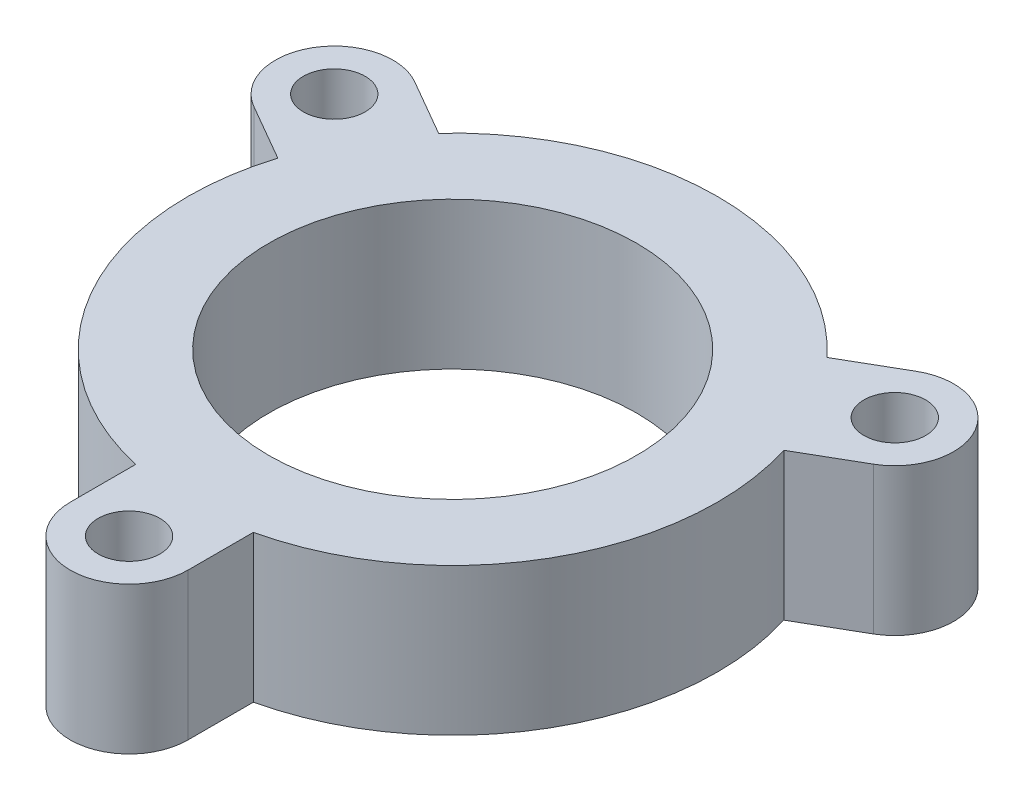
ISO-10303-21;
HEADER;
FILE_DESCRIPTION(('STEP AP214'),'2;1');
FILE_NAME('part.step','',(''),(''),'','','');
FILE_SCHEMA(('AUTOMOTIVE_DESIGN { 1 0 10303 214 1 1 1 1 }'));
ENDSEC;
DATA;
#1=APPLICATION_CONTEXT('core data for automotive mechanical design processes');
#2=APPLICATION_PROTOCOL_DEFINITION('international standard','automotive_design',2000,#1);
#3=PRODUCT_CONTEXT('',#1,'mechanical');
#4=PRODUCT('Part','Part','',(#3));
#5=PRODUCT_RELATED_PRODUCT_CATEGORY('part','',(#4));
#6=PRODUCT_DEFINITION_FORMATION('','',#4);
#7=PRODUCT_DEFINITION_CONTEXT('part definition',#1,'design');
#8=PRODUCT_DEFINITION('design','',#6,#7);
#9=PRODUCT_DEFINITION_SHAPE('','',#8);
#10=(LENGTH_UNIT() NAMED_UNIT(*) SI_UNIT(.MILLI.,.METRE.));
#11=(NAMED_UNIT(*) PLANE_ANGLE_UNIT() SI_UNIT($,.RADIAN.));
#12=(NAMED_UNIT(*) SI_UNIT($,.STERADIAN.) SOLID_ANGLE_UNIT());
#13=UNCERTAINTY_MEASURE_WITH_UNIT(LENGTH_MEASURE(1.E-05),#10,'distance_accuracy_value','');
#14=(GEOMETRIC_REPRESENTATION_CONTEXT(3) GLOBAL_UNCERTAINTY_ASSIGNED_CONTEXT((#13)) GLOBAL_UNIT_ASSIGNED_CONTEXT((#10,
#11,#12)) REPRESENTATION_CONTEXT('',''));
#15=CARTESIAN_POINT('',(0.,0.,0.));
#16=DIRECTION('',(0.,0.,1.));
#17=DIRECTION('',(1.,0.,0.));
#18=AXIS2_PLACEMENT_3D('',#15,#16,#17);
#19=CARTESIAN_POINT('',(0.,10.,22.));
#20=DIRECTION('',(0.,-1.,0.));
#21=DIRECTION('',(0.,0.,-1.));
#22=AXIS2_PLACEMENT_3D('',#19,#20,#21);
#23=CYLINDRICAL_SURFACE('',#22,2.1);
#24=CARTESIAN_POINT('',(0.,10.,22.));
#25=DIRECTION('',(0.,1.,0.));
#26=DIRECTION('',(0.,0.,1.));
#27=AXIS2_PLACEMENT_3D('',#24,#25,#26);
#28=CIRCLE('',#27,2.1);
#29=CARTESIAN_POINT('',(0.,10.,24.1));
#30=VERTEX_POINT('',#29);
#31=EDGE_CURVE('E242',#30,#30,#28,.T.);
#32=ORIENTED_EDGE('',*,*,#31,.T.);
#33=EDGE_LOOP('',(#32));
#34=FACE_BOUND('',#33,.T.);
#35=CARTESIAN_POINT('',(0.,0.,22.));
#36=DIRECTION('',(0.,1.,0.));
#37=DIRECTION('',(0.,0.,1.));
#38=AXIS2_PLACEMENT_3D('',#35,#36,#37);
#39=CIRCLE('',#38,2.1);
#40=CARTESIAN_POINT('',(0.,0.,24.1));
#41=VERTEX_POINT('',#40);
#42=EDGE_CURVE('E279',#41,#41,#39,.T.);
#43=ORIENTED_EDGE('',*,*,#42,.F.);
#44=EDGE_LOOP('',(#43));
#45=FACE_BOUND('',#44,.T.);
#46=ADVANCED_FACE('F118',(#34,#45),#23,.F.);
#47=CARTESIAN_POINT('',(0.,0.,0.));
#48=DIRECTION('',(0.,1.,0.));
#49=DIRECTION('',(0.,0.,1.));
#50=AXIS2_PLACEMENT_3D('',#47,#48,#49);
#51=PLANE('',#50);
#52=CARTESIAN_POINT('',(0.,0.,22.));
#53=DIRECTION('',(0.,1.,0.));
#54=DIRECTION('',(0.,0.,1.));
#55=AXIS2_PLACEMENT_3D('',#52,#53,#54);
#56=CIRCLE('',#55,4.);
#57=CARTESIAN_POINT('',(-4.,0.,22.));
#58=VERTEX_POINT('',#57);
#59=CARTESIAN_POINT('',(4.,0.,22.));
#60=VERTEX_POINT('',#59);
#61=EDGE_CURVE('E254',#58,#60,#56,.T.);
#62=ORIENTED_EDGE('',*,*,#61,.F.);
#63=DIRECTION('',(0.,0.,-1.));
#64=VECTOR('',#63,1.);
#65=CARTESIAN_POINT('',(-4.,0.,0.));
#66=LINE('',#65,#64);
#67=CARTESIAN_POINT('',(-4.,0.,17.5499287747842));
#68=VERTEX_POINT('',#67);
#69=EDGE_CURVE('E251',#58,#68,#66,.T.);
#70=ORIENTED_EDGE('',*,*,#69,.T.);
#71=CARTESIAN_POINT('',(0.,0.,0.));
#72=DIRECTION('',(0.,1.,0.));
#73=DIRECTION('',(0.,0.,1.));
#74=AXIS2_PLACEMENT_3D('',#71,#72,#73);
#75=CIRCLE('',#74,18.);
#76=CARTESIAN_POINT('',(-17.1986841535706,0.,-5.31086277225445));
#77=VERTEX_POINT('',#76);
#78=EDGE_CURVE('E263',#77,#68,#75,.T.);
#79=ORIENTED_EDGE('',*,*,#78,.F.);
#80=DIRECTION('',(0.866025403784436,0.,0.500000000000004));
#81=VECTOR('',#80,1.);
#82=CARTESIAN_POINT('',(-2.00000000000001,0.,3.46410161513774));
#83=LINE('',#82,#81);
#84=CARTESIAN_POINT('',(-21.0525588832576,0.,-7.53589838486234));
#85=VERTEX_POINT('',#84);
#86=EDGE_CURVE('E175',#85,#77,#83,.T.);
#87=ORIENTED_EDGE('',*,*,#86,.F.);
#88=CARTESIAN_POINT('',(-19.0525588832576,0.,-11.0000000000001));
#89=DIRECTION('',(0.,1.,0.));
#90=DIRECTION('',(0.,0.,1.));
#91=AXIS2_PLACEMENT_3D('',#88,#89,#90);
#92=CIRCLE('',#91,4.);
#93=CARTESIAN_POINT('',(-17.0525588832576,0.,-14.4641016151378));
#94=VERTEX_POINT('',#93);
#95=EDGE_CURVE('E228',#94,#85,#92,.T.);
#96=ORIENTED_EDGE('',*,*,#95,.F.);
#97=DIRECTION('',(0.866025403784436,0.,0.500000000000004));
#98=VECTOR('',#97,1.);
#99=CARTESIAN_POINT('',(2.00000000000002,0.,-3.46410161513775));
#100=LINE('',#99,#98);
#101=CARTESIAN_POINT('',(-13.1986841535706,0.,-12.2390660025299));
#102=VERTEX_POINT('',#101);
#103=EDGE_CURVE('E271',#94,#102,#100,.T.);
#104=ORIENTED_EDGE('',*,*,#103,.T.);
#105=CARTESIAN_POINT('',(13.1986841535708,0.,-12.2390660025298));
#106=VERTEX_POINT('',#105);
#107=EDGE_CURVE('E264',#106,#102,#75,.T.);
#108=ORIENTED_EDGE('',*,*,#107,.F.);
#109=DIRECTION('',(-0.866025403784443,0.,0.499999999999992));
#110=VECTOR('',#109,1.);
#111=CARTESIAN_POINT('',(-1.99999999999997,0.,-3.46410161513777));
#112=LINE('',#111,#110);
#113=CARTESIAN_POINT('',(17.0525588832578,0.,-14.4641016151376));
#114=VERTEX_POINT('',#113);
#115=EDGE_CURVE('E269',#114,#106,#112,.T.);
#116=ORIENTED_EDGE('',*,*,#115,.F.);
#117=CARTESIAN_POINT('',(19.0525588832578,0.,-10.9999999999998));
#118=DIRECTION('',(0.,1.,0.));
#119=DIRECTION('',(0.,0.,1.));
#120=AXIS2_PLACEMENT_3D('',#117,#118,#119);
#121=CIRCLE('',#120,4.);
#122=CARTESIAN_POINT('',(21.0525588832577,0.,-7.53589838486205));
#123=VERTEX_POINT('',#122);
#124=EDGE_CURVE('E267',#123,#114,#121,.T.);
#125=ORIENTED_EDGE('',*,*,#124,.F.);
#126=DIRECTION('',(-0.866025403784443,0.,0.499999999999992));
#127=VECTOR('',#126,1.);
#128=CARTESIAN_POINT('',(1.99999999999997,0.,3.46410161513777));
#129=LINE('',#128,#127);
#130=CARTESIAN_POINT('',(17.1986841535707,0.,-5.31086277225421));
#131=VERTEX_POINT('',#130);
#132=EDGE_CURVE('E262',#123,#131,#129,.T.);
#133=ORIENTED_EDGE('',*,*,#132,.T.);
#134=CARTESIAN_POINT('',(4.,0.,17.5499287747842));
#135=VERTEX_POINT('',#134);
#136=EDGE_CURVE('E259',#135,#131,#75,.T.);
#137=ORIENTED_EDGE('',*,*,#136,.F.);
#138=DIRECTION('',(0.,0.,-1.));
#139=VECTOR('',#138,1.);
#140=CARTESIAN_POINT('',(4.,0.,0.));
#141=LINE('',#140,#139);
#142=EDGE_CURVE('E257',#60,#135,#141,.T.);
#143=ORIENTED_EDGE('',*,*,#142,.F.);
#144=EDGE_LOOP('',(#62,#70,#79,#87,#96,#104,#108,#116,#125,#133,#137,#143));
#145=FACE_BOUND('',#144,.T.);
#146=ORIENTED_EDGE('',*,*,#42,.T.);
#147=EDGE_LOOP('',(#146));
#148=FACE_BOUND('',#147,.T.);
#149=CARTESIAN_POINT('',(-19.0525588832576,0.,-11.0000000000001));
#150=DIRECTION('',(0.,1.,0.));
#151=DIRECTION('',(0.,0.,1.));
#152=AXIS2_PLACEMENT_3D('',#149,#150,#151);
#153=CIRCLE('',#152,2.1);
#154=CARTESIAN_POINT('',(-19.0525588832576,0.,-8.90000000000009));
#155=VERTEX_POINT('',#154);
#156=EDGE_CURVE('E285',#155,#155,#153,.T.);
#157=ORIENTED_EDGE('',*,*,#156,.T.);
#158=EDGE_LOOP('',(#157));
#159=FACE_BOUND('',#158,.T.);
#160=CARTESIAN_POINT('',(19.0525588832578,0.,-10.9999999999998));
#161=DIRECTION('',(0.,1.,0.));
#162=DIRECTION('',(0.,0.,1.));
#163=AXIS2_PLACEMENT_3D('',#160,#161,#162);
#164=CIRCLE('',#163,2.1);
#165=CARTESIAN_POINT('',(19.0525588832578,0.,-8.89999999999982));
#166=VERTEX_POINT('',#165);
#167=EDGE_CURVE('E282',#166,#166,#164,.T.);
#168=ORIENTED_EDGE('',*,*,#167,.T.);
#169=EDGE_LOOP('',(#168));
#170=FACE_BOUND('',#169,.T.);
#171=CARTESIAN_POINT('',(0.,0.,0.));
#172=DIRECTION('',(0.,1.,0.));
#173=DIRECTION('',(0.,0.,1.));
#174=AXIS2_PLACEMENT_3D('',#171,#172,#173);
#175=CIRCLE('',#174,12.5);
#176=CARTESIAN_POINT('',(0.,0.,12.5));
#177=VERTEX_POINT('',#176);
#178=EDGE_CURVE('E276',#177,#177,#175,.T.);
#179=ORIENTED_EDGE('',*,*,#178,.T.);
#180=EDGE_LOOP('',(#179));
#181=FACE_BOUND('',#180,.T.);
#182=ADVANCED_FACE('F317',(#145,#148,#159,#170,#181),#51,.F.);
#183=CARTESIAN_POINT('',(0.,10.,22.));
#184=DIRECTION('',(0.,-1.,0.));
#185=DIRECTION('',(0.,0.,-1.));
#186=AXIS2_PLACEMENT_3D('',#183,#184,#185);
#187=CYLINDRICAL_SURFACE('',#186,4.);
#188=ORIENTED_EDGE('',*,*,#61,.T.);
#189=DIRECTION('',(0.,-1.,0.));
#190=VECTOR('',#189,1.);
#191=CARTESIAN_POINT('',(4.,10.,22.));
#192=LINE('',#191,#190);
#193=CARTESIAN_POINT('',(4.,10.,22.));
#194=VERTEX_POINT('',#193);
#195=EDGE_CURVE('E127',#194,#60,#192,.T.);
#196=ORIENTED_EDGE('',*,*,#195,.F.);
#197=CARTESIAN_POINT('',(0.,10.,22.));
#198=DIRECTION('',(0.,1.,0.));
#199=DIRECTION('',(0.,0.,1.));
#200=AXIS2_PLACEMENT_3D('',#197,#198,#199);
#201=CIRCLE('',#200,4.);
#202=CARTESIAN_POINT('',(-4.,10.,22.));
#203=VERTEX_POINT('',#202);
#204=EDGE_CURVE('E330',#203,#194,#201,.T.);
#205=ORIENTED_EDGE('',*,*,#204,.F.);
#206=DIRECTION('',(0.,-1.,0.));
#207=VECTOR('',#206,1.);
#208=CARTESIAN_POINT('',(-4.,10.,22.));
#209=LINE('',#208,#207);
#210=EDGE_CURVE('E12',#203,#58,#209,.T.);
#211=ORIENTED_EDGE('',*,*,#210,.T.);
#212=EDGE_LOOP('',(#188,#196,#205,#211));
#213=FACE_BOUND('',#212,.T.);
#214=ADVANCED_FACE('F314',(#213),#187,.T.);
#215=CARTESIAN_POINT('',(0.,10.,0.));
#216=DIRECTION('',(0.,1.,0.));
#217=DIRECTION('',(0.,0.,1.));
#218=AXIS2_PLACEMENT_3D('',#215,#216,#217);
#219=PLANE('',#218);
#220=ORIENTED_EDGE('',*,*,#204,.T.);
#221=DIRECTION('',(0.,0.,-1.));
#222=VECTOR('',#221,1.);
#223=CARTESIAN_POINT('',(4.,10.,0.));
#224=LINE('',#223,#222);
#225=CARTESIAN_POINT('',(4.,10.,17.5499287747842));
#226=VERTEX_POINT('',#225);
#227=EDGE_CURVE('E311',#194,#226,#224,.T.);
#228=ORIENTED_EDGE('',*,*,#227,.T.);
#229=CARTESIAN_POINT('',(0.,10.,0.));
#230=DIRECTION('',(0.,1.,0.));
#231=DIRECTION('',(0.,0.,1.));
#232=AXIS2_PLACEMENT_3D('',#229,#230,#231);
#233=CIRCLE('',#232,18.);
#234=CARTESIAN_POINT('',(17.1986841535707,10.,-5.31086277225421));
#235=VERTEX_POINT('',#234);
#236=EDGE_CURVE('E237',#226,#235,#233,.T.);
#237=ORIENTED_EDGE('',*,*,#236,.T.);
#238=DIRECTION('',(-0.866025403784443,0.,0.499999999999992));
#239=VECTOR('',#238,1.);
#240=CARTESIAN_POINT('',(1.99999999999997,10.,3.46410161513777));
#241=LINE('',#240,#239);
#242=CARTESIAN_POINT('',(21.0525588832577,10.,-7.53589838486205));
#243=VERTEX_POINT('',#242);
#244=EDGE_CURVE('E327',#243,#235,#241,.T.);
#245=ORIENTED_EDGE('',*,*,#244,.F.);
#246=CARTESIAN_POINT('',(19.0525588832578,10.,-10.9999999999998));
#247=DIRECTION('',(0.,1.,0.));
#248=DIRECTION('',(0.,0.,1.));
#249=AXIS2_PLACEMENT_3D('',#246,#247,#248);
#250=CIRCLE('',#249,4.);
#251=CARTESIAN_POINT('',(17.0525588832578,10.,-14.4641016151376));
#252=VERTEX_POINT('',#251);
#253=EDGE_CURVE('E328',#243,#252,#250,.T.);
#254=ORIENTED_EDGE('',*,*,#253,.T.);
#255=DIRECTION('',(-0.866025403784443,0.,0.499999999999992));
#256=VECTOR('',#255,1.);
#257=CARTESIAN_POINT('',(-1.99999999999997,10.,-3.46410161513777));
#258=LINE('',#257,#256);
#259=CARTESIAN_POINT('',(13.1986841535708,10.,-12.2390660025298));
#260=VERTEX_POINT('',#259);
#261=EDGE_CURVE('E332',#252,#260,#258,.T.);
#262=ORIENTED_EDGE('',*,*,#261,.T.);
#263=CARTESIAN_POINT('',(-13.1986841535706,10.,-12.2390660025299));
#264=VERTEX_POINT('',#263);
#265=EDGE_CURVE('E236',#260,#264,#233,.T.);
#266=ORIENTED_EDGE('',*,*,#265,.T.);
#267=DIRECTION('',(0.866025403784436,0.,0.500000000000004));
#268=VECTOR('',#267,1.);
#269=CARTESIAN_POINT('',(2.00000000000002,10.,-3.46410161513775));
#270=LINE('',#269,#268);
#271=CARTESIAN_POINT('',(-17.0525588832576,10.,-14.4641016151378));
#272=VERTEX_POINT('',#271);
#273=EDGE_CURVE('E222',#272,#264,#270,.T.);
#274=ORIENTED_EDGE('',*,*,#273,.F.);
#275=CARTESIAN_POINT('',(-19.0525588832576,10.,-11.0000000000001));
#276=DIRECTION('',(0.,1.,0.));
#277=DIRECTION('',(0.,0.,1.));
#278=AXIS2_PLACEMENT_3D('',#275,#276,#277);
#279=CIRCLE('',#278,4.);
#280=CARTESIAN_POINT('',(-21.0525588832576,10.,-7.53589838486234));
#281=VERTEX_POINT('',#280);
#282=EDGE_CURVE('E214',#272,#281,#279,.T.);
#283=ORIENTED_EDGE('',*,*,#282,.T.);
#284=DIRECTION('',(0.866025403784436,0.,0.500000000000004));
#285=VECTOR('',#284,1.);
#286=CARTESIAN_POINT('',(-2.00000000000001,10.,3.46410161513774));
#287=LINE('',#286,#285);
#288=CARTESIAN_POINT('',(-17.1986841535706,10.,-5.31086277225445));
#289=VERTEX_POINT('',#288);
#290=EDGE_CURVE('E220',#281,#289,#287,.T.);
#291=ORIENTED_EDGE('',*,*,#290,.T.);
#292=CARTESIAN_POINT('',(-4.,10.,17.5499287747842));
#293=VERTEX_POINT('',#292);
#294=EDGE_CURVE('E135',#289,#293,#233,.T.);
#295=ORIENTED_EDGE('',*,*,#294,.T.);
#296=DIRECTION('',(0.,0.,-1.));
#297=VECTOR('',#296,1.);
#298=CARTESIAN_POINT('',(-4.,10.,0.));
#299=LINE('',#298,#297);
#300=EDGE_CURVE('E288',#203,#293,#299,.T.);
#301=ORIENTED_EDGE('',*,*,#300,.F.);
#302=EDGE_LOOP('',(#220,#228,#237,#245,#254,#262,#266,#274,#283,#291,#295,#301));
#303=FACE_BOUND('',#302,.T.);
#304=ORIENTED_EDGE('',*,*,#31,.F.);
#305=EDGE_LOOP('',(#304));
#306=FACE_BOUND('',#305,.T.);
#307=CARTESIAN_POINT('',(-19.0525588832576,10.,-11.0000000000001));
#308=DIRECTION('',(0.,1.,0.));
#309=DIRECTION('',(0.,0.,1.));
#310=AXIS2_PLACEMENT_3D('',#307,#308,#309);
#311=CIRCLE('',#310,2.1);
#312=CARTESIAN_POINT('',(-19.0525588832576,10.,-8.90000000000009));
#313=VERTEX_POINT('',#312);
#314=EDGE_CURVE('E248',#313,#313,#311,.T.);
#315=ORIENTED_EDGE('',*,*,#314,.F.);
#316=EDGE_LOOP('',(#315));
#317=FACE_BOUND('',#316,.T.);
#318=CARTESIAN_POINT('',(19.0525588832578,10.,-10.9999999999998));
#319=DIRECTION('',(0.,1.,0.));
#320=DIRECTION('',(0.,0.,1.));
#321=AXIS2_PLACEMENT_3D('',#318,#319,#320);
#322=CIRCLE('',#321,2.1);
#323=CARTESIAN_POINT('',(19.0525588832578,10.,-8.89999999999982));
#324=VERTEX_POINT('',#323);
#325=EDGE_CURVE('E245',#324,#324,#322,.T.);
#326=ORIENTED_EDGE('',*,*,#325,.F.);
#327=EDGE_LOOP('',(#326));
#328=FACE_BOUND('',#327,.T.);
#329=CARTESIAN_POINT('',(0.,10.,0.));
#330=DIRECTION('',(0.,1.,0.));
#331=DIRECTION('',(0.,0.,1.));
#332=AXIS2_PLACEMENT_3D('',#329,#330,#331);
#333=CIRCLE('',#332,12.5);
#334=CARTESIAN_POINT('',(0.,10.,12.5));
#335=VERTEX_POINT('',#334);
#336=EDGE_CURVE('E234',#335,#335,#333,.T.);
#337=ORIENTED_EDGE('',*,*,#336,.F.);
#338=EDGE_LOOP('',(#337));
#339=FACE_BOUND('',#338,.T.);
#340=ADVANCED_FACE('F217',(#303,#306,#317,#328,#339),#219,.T.);
#341=CARTESIAN_POINT('',(4.,10.,0.));
#342=DIRECTION('',(-1.,0.,0.));
#343=DIRECTION('',(0.,0.,1.));
#344=AXIS2_PLACEMENT_3D('',#341,#342,#343);
#345=PLANE('',#344);
#346=ORIENTED_EDGE('',*,*,#142,.T.);
#347=DIRECTION('',(0.,-1.,0.));
#348=VECTOR('',#347,1.);
#349=CARTESIAN_POINT('',(4.,10.,17.5499287747842));
#350=LINE('',#349,#348);
#351=EDGE_CURVE('E304',#226,#135,#350,.T.);
#352=ORIENTED_EDGE('',*,*,#351,.F.);
#353=ORIENTED_EDGE('',*,*,#227,.F.);
#354=ORIENTED_EDGE('',*,*,#195,.T.);
#355=EDGE_LOOP('',(#346,#352,#353,#354));
#356=FACE_BOUND('',#355,.T.);
#357=ADVANCED_FACE('F308',(#356),#345,.F.);
#358=CARTESIAN_POINT('',(0.,10.,0.));
#359=DIRECTION('',(0.,-1.,0.));
#360=DIRECTION('',(0.,0.,-1.));
#361=AXIS2_PLACEMENT_3D('',#358,#359,#360);
#362=CYLINDRICAL_SURFACE('',#361,18.);
#363=ORIENTED_EDGE('',*,*,#136,.T.);
#364=DIRECTION('',(0.,-1.,0.));
#365=VECTOR('',#364,1.);
#366=CARTESIAN_POINT('',(17.1986841535707,10.,-5.31086277225421));
#367=LINE('',#366,#365);
#368=EDGE_CURVE('E302',#235,#131,#367,.T.);
#369=ORIENTED_EDGE('',*,*,#368,.F.);
#370=ORIENTED_EDGE('',*,*,#236,.F.);
#371=ORIENTED_EDGE('',*,*,#351,.T.);
#372=EDGE_LOOP('',(#363,#369,#370,#371));
#373=FACE_BOUND('',#372,.T.);
#374=ADVANCED_FACE('F323',(#373),#362,.T.);
#375=CARTESIAN_POINT('',(1.99999999999997,10.,3.46410161513777));
#376=DIRECTION('',(0.499999999999992,0.,0.866025403784443));
#377=DIRECTION('',(0.866025403784443,0.,-0.499999999999992));
#378=AXIS2_PLACEMENT_3D('',#375,#376,#377);
#379=PLANE('',#378);
#380=ORIENTED_EDGE('',*,*,#132,.F.);
#381=DIRECTION('',(0.,-1.,0.));
#382=VECTOR('',#381,1.);
#383=CARTESIAN_POINT('',(21.0525588832577,10.,-7.53589838486205));
#384=LINE('',#383,#382);
#385=EDGE_CURVE('E300',#243,#123,#384,.T.);
#386=ORIENTED_EDGE('',*,*,#385,.F.);
#387=ORIENTED_EDGE('',*,*,#244,.T.);
#388=ORIENTED_EDGE('',*,*,#368,.T.);
#389=EDGE_LOOP('',(#380,#386,#387,#388));
#390=FACE_BOUND('',#389,.T.);
#391=ADVANCED_FACE('F395',(#390),#379,.T.);
#392=CARTESIAN_POINT('',(19.0525588832578,10.,-10.9999999999998));
#393=DIRECTION('',(0.,-1.,0.));
#394=DIRECTION('',(0.,0.,-1.));
#395=AXIS2_PLACEMENT_3D('',#392,#393,#394);
#396=CYLINDRICAL_SURFACE('',#395,4.);
#397=ORIENTED_EDGE('',*,*,#124,.T.);
#398=DIRECTION('',(0.,-1.,0.));
#399=VECTOR('',#398,1.);
#400=CARTESIAN_POINT('',(17.0525588832578,10.,-14.4641016151376));
#401=LINE('',#400,#399);
#402=EDGE_CURVE('E297',#252,#114,#401,.T.);
#403=ORIENTED_EDGE('',*,*,#402,.F.);
#404=ORIENTED_EDGE('',*,*,#253,.F.);
#405=ORIENTED_EDGE('',*,*,#385,.T.);
#406=EDGE_LOOP('',(#397,#403,#404,#405));
#407=FACE_BOUND('',#406,.T.);
#408=ADVANCED_FACE('F342',(#407),#396,.T.);
#409=CARTESIAN_POINT('',(-1.99999999999997,10.,-3.46410161513777));
#410=DIRECTION('',(0.499999999999992,0.,0.866025403784443));
#411=DIRECTION('',(0.866025403784443,0.,-0.499999999999992));
#412=AXIS2_PLACEMENT_3D('',#409,#410,#411);
#413=PLANE('',#412);
#414=ORIENTED_EDGE('',*,*,#115,.T.);
#415=DIRECTION('',(0.,-1.,0.));
#416=VECTOR('',#415,1.);
#417=CARTESIAN_POINT('',(13.1986841535708,10.,-12.2390660025298));
#418=LINE('',#417,#416);
#419=EDGE_CURVE('E294',#260,#106,#418,.T.);
#420=ORIENTED_EDGE('',*,*,#419,.F.);
#421=ORIENTED_EDGE('',*,*,#261,.F.);
#422=ORIENTED_EDGE('',*,*,#402,.T.);
#423=EDGE_LOOP('',(#414,#420,#421,#422));
#424=FACE_BOUND('',#423,.T.);
#425=ADVANCED_FACE('F345',(#424),#413,.F.);
#426=ORIENTED_EDGE('',*,*,#107,.T.);
#427=DIRECTION('',(0.,-1.,0.));
#428=VECTOR('',#427,1.);
#429=CARTESIAN_POINT('',(-13.1986841535706,10.,-12.2390660025299));
#430=LINE('',#429,#428);
#431=EDGE_CURVE('E292',#264,#102,#430,.T.);
#432=ORIENTED_EDGE('',*,*,#431,.F.);
#433=ORIENTED_EDGE('',*,*,#265,.F.);
#434=ORIENTED_EDGE('',*,*,#419,.T.);
#435=EDGE_LOOP('',(#426,#432,#433,#434));
#436=FACE_BOUND('',#435,.T.);
#437=ADVANCED_FACE('F349',(#436),#362,.T.);
#438=CARTESIAN_POINT('',(2.00000000000002,10.,-3.46410161513775));
#439=DIRECTION('',(0.500000000000004,0.,-0.866025403784437));
#440=DIRECTION('',(-0.866025403784437,0.,-0.500000000000004));
#441=AXIS2_PLACEMENT_3D('',#438,#439,#440);
#442=PLANE('',#441);
#443=ORIENTED_EDGE('',*,*,#103,.F.);
#444=DIRECTION('',(0.,-1.,0.));
#445=VECTOR('',#444,1.);
#446=CARTESIAN_POINT('',(-17.0525588832576,10.,-14.4641016151378));
#447=LINE('',#446,#445);
#448=EDGE_CURVE('E229',#272,#94,#447,.T.);
#449=ORIENTED_EDGE('',*,*,#448,.F.);
#450=ORIENTED_EDGE('',*,*,#273,.T.);
#451=ORIENTED_EDGE('',*,*,#431,.T.);
#452=EDGE_LOOP('',(#443,#449,#450,#451));
#453=FACE_BOUND('',#452,.T.);
#454=ADVANCED_FACE('F352',(#453),#442,.T.);
#455=CARTESIAN_POINT('',(-19.0525588832576,10.,-11.0000000000001));
#456=DIRECTION('',(0.,-1.,0.));
#457=DIRECTION('',(0.,0.,-1.));
#458=AXIS2_PLACEMENT_3D('',#455,#456,#457);
#459=CYLINDRICAL_SURFACE('',#458,4.);
#460=ORIENTED_EDGE('',*,*,#95,.T.);
#461=DIRECTION('',(0.,-1.,0.));
#462=VECTOR('',#461,1.);
#463=CARTESIAN_POINT('',(-21.0525588832576,10.,-7.53589838486234));
#464=LINE('',#463,#462);
#465=EDGE_CURVE('E225',#281,#85,#464,.T.);
#466=ORIENTED_EDGE('',*,*,#465,.F.);
#467=ORIENTED_EDGE('',*,*,#282,.F.);
#468=ORIENTED_EDGE('',*,*,#448,.T.);
#469=EDGE_LOOP('',(#460,#466,#467,#468));
#470=FACE_BOUND('',#469,.T.);
#471=ADVANCED_FACE('F226',(#470),#459,.T.);
#472=CARTESIAN_POINT('',(-2.00000000000001,10.,3.46410161513774));
#473=DIRECTION('',(0.500000000000004,0.,-0.866025403784437));
#474=DIRECTION('',(-0.866025403784437,0.,-0.500000000000004));
#475=AXIS2_PLACEMENT_3D('',#472,#473,#474);
#476=PLANE('',#475);
#477=ORIENTED_EDGE('',*,*,#86,.T.);
#478=DIRECTION('',(0.,-1.,0.));
#479=VECTOR('',#478,1.);
#480=CARTESIAN_POINT('',(-17.1986841535706,10.,-5.31086277225445));
#481=LINE('',#480,#479);
#482=EDGE_CURVE('E230',#289,#77,#481,.T.);
#483=ORIENTED_EDGE('',*,*,#482,.F.);
#484=ORIENTED_EDGE('',*,*,#290,.F.);
#485=ORIENTED_EDGE('',*,*,#465,.T.);
#486=EDGE_LOOP('',(#477,#483,#484,#485));
#487=FACE_BOUND('',#486,.T.);
#488=ADVANCED_FACE('F232',(#487),#476,.F.);
#489=ORIENTED_EDGE('',*,*,#78,.T.);
#490=DIRECTION('',(0.,-1.,0.));
#491=VECTOR('',#490,1.);
#492=CARTESIAN_POINT('',(-4.,10.,17.5499287747842));
#493=LINE('',#492,#491);
#494=EDGE_CURVE('E182',#293,#68,#493,.T.);
#495=ORIENTED_EDGE('',*,*,#494,.F.);
#496=ORIENTED_EDGE('',*,*,#294,.F.);
#497=ORIENTED_EDGE('',*,*,#482,.T.);
#498=EDGE_LOOP('',(#489,#495,#496,#497));
#499=FACE_BOUND('',#498,.T.);
#500=ADVANCED_FACE('F355',(#499),#362,.T.);
#501=CARTESIAN_POINT('',(-4.,10.,0.));
#502=DIRECTION('',(-1.,0.,0.));
#503=DIRECTION('',(0.,0.,1.));
#504=AXIS2_PLACEMENT_3D('',#501,#502,#503);
#505=PLANE('',#504);
#506=ORIENTED_EDGE('',*,*,#69,.F.);
#507=ORIENTED_EDGE('',*,*,#210,.F.);
#508=ORIENTED_EDGE('',*,*,#300,.T.);
#509=ORIENTED_EDGE('',*,*,#494,.T.);
#510=EDGE_LOOP('',(#506,#507,#508,#509));
#511=FACE_BOUND('',#510,.T.);
#512=ADVANCED_FACE('F120',(#511),#505,.T.);
#513=CARTESIAN_POINT('',(0.,10.,0.));
#514=DIRECTION('',(0.,-1.,0.));
#515=DIRECTION('',(0.,0.,-1.));
#516=AXIS2_PLACEMENT_3D('',#513,#514,#515);
#517=CYLINDRICAL_SURFACE('',#516,12.5);
#518=ORIENTED_EDGE('',*,*,#336,.T.);
#519=EDGE_LOOP('',(#518));
#520=FACE_BOUND('',#519,.T.);
#521=ORIENTED_EDGE('',*,*,#178,.F.);
#522=EDGE_LOOP('',(#521));
#523=FACE_BOUND('',#522,.T.);
#524=ADVANCED_FACE('F359',(#520,#523),#517,.F.);
#525=CARTESIAN_POINT('',(19.0525588832578,10.,-10.9999999999998));
#526=DIRECTION('',(0.,-1.,0.));
#527=DIRECTION('',(0.,0.,-1.));
#528=AXIS2_PLACEMENT_3D('',#525,#526,#527);
#529=CYLINDRICAL_SURFACE('',#528,2.1);
#530=ORIENTED_EDGE('',*,*,#325,.T.);
#531=EDGE_LOOP('',(#530));
#532=FACE_BOUND('',#531,.T.);
#533=ORIENTED_EDGE('',*,*,#167,.F.);
#534=EDGE_LOOP('',(#533));
#535=FACE_BOUND('',#534,.T.);
#536=ADVANCED_FACE('F364',(#532,#535),#529,.F.);
#537=CARTESIAN_POINT('',(-19.0525588832576,10.,-11.0000000000001));
#538=DIRECTION('',(0.,-1.,0.));
#539=DIRECTION('',(0.,0.,-1.));
#540=AXIS2_PLACEMENT_3D('',#537,#538,#539);
#541=CYLINDRICAL_SURFACE('',#540,2.1);
#542=ORIENTED_EDGE('',*,*,#314,.T.);
#543=EDGE_LOOP('',(#542));
#544=FACE_BOUND('',#543,.T.);
#545=ORIENTED_EDGE('',*,*,#156,.F.);
#546=EDGE_LOOP('',(#545));
#547=FACE_BOUND('',#546,.T.);
#548=ADVANCED_FACE('F378',(#544,#547),#541,.F.);
#549=CLOSED_SHELL('',(#46,#182,#214,#340,#357,#374,#391,#408,#425,#437,#454,#471,#488,#500,#512,
#524,#536,#548));
#550=MANIFOLD_SOLID_BREP('B2',#549);
#551=ADVANCED_BREP_SHAPE_REPRESENTATION('',(#18,#550),#14);
#552=SHAPE_DEFINITION_REPRESENTATION(#9,#551);
ENDSEC;
END-ISO-10303-21;
